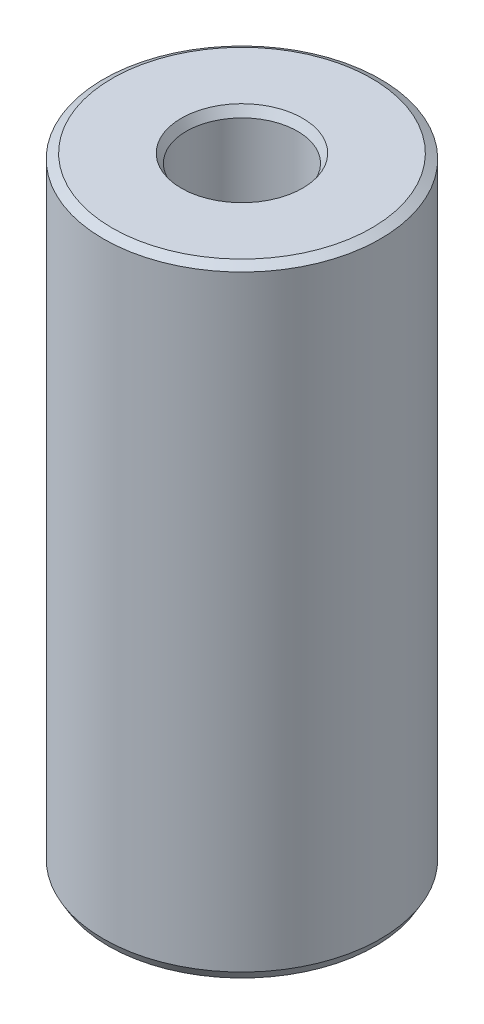
ISO-10303-21;
HEADER;
FILE_DESCRIPTION(('STEP AP214'),'2;1');
FILE_NAME('part.step','',(''),(''),'','','');
FILE_SCHEMA(('AUTOMOTIVE_DESIGN { 1 0 10303 214 1 1 1 1 }'));
ENDSEC;
DATA;
#1=APPLICATION_CONTEXT('core data for automotive mechanical design processes');
#2=APPLICATION_PROTOCOL_DEFINITION('international standard','automotive_design',2000,#1);
#3=PRODUCT_CONTEXT('',#1,'mechanical');
#4=PRODUCT('Part','Part','',(#3));
#5=PRODUCT_RELATED_PRODUCT_CATEGORY('part','',(#4));
#6=PRODUCT_DEFINITION_FORMATION('','',#4);
#7=PRODUCT_DEFINITION_CONTEXT('part definition',#1,'design');
#8=PRODUCT_DEFINITION('design','',#6,#7);
#9=PRODUCT_DEFINITION_SHAPE('','',#8);
#10=(LENGTH_UNIT() NAMED_UNIT(*) SI_UNIT(.MILLI.,.METRE.));
#11=(NAMED_UNIT(*) PLANE_ANGLE_UNIT() SI_UNIT($,.RADIAN.));
#12=(NAMED_UNIT(*) SI_UNIT($,.STERADIAN.) SOLID_ANGLE_UNIT());
#13=UNCERTAINTY_MEASURE_WITH_UNIT(LENGTH_MEASURE(1.E-05),#10,'distance_accuracy_value','');
#14=(GEOMETRIC_REPRESENTATION_CONTEXT(3) GLOBAL_UNCERTAINTY_ASSIGNED_CONTEXT((#13)) GLOBAL_UNIT_ASSIGNED_CONTEXT((#10,
#11,#12)) REPRESENTATION_CONTEXT('',''));
#15=CARTESIAN_POINT('',(0.,0.,0.));
#16=DIRECTION('',(0.,0.,1.));
#17=DIRECTION('',(1.,0.,0.));
#18=AXIS2_PLACEMENT_3D('',#15,#16,#17);
#19=CARTESIAN_POINT('',(0.,44.7857377035556,0.));
#20=DIRECTION('',(0.,-1.,0.));
#21=DIRECTION('',(0.,0.,-1.));
#22=AXIS2_PLACEMENT_3D('',#19,#20,#21);
#23=CYLINDRICAL_SURFACE('',#22,10.);
#24=CARTESIAN_POINT('',(0.,0.631946822583843,0.));
#25=DIRECTION('',(0.,1.,0.));
#26=DIRECTION('',(0.,0.,1.));
#27=AXIS2_PLACEMENT_3D('',#24,#25,#26);
#28=CIRCLE('',#27,10.);
#29=CARTESIAN_POINT('',(0.,0.631946822583842,10.));
#30=VERTEX_POINT('',#29);
#31=EDGE_CURVE('E10',#30,#30,#28,.T.);
#32=ORIENTED_EDGE('',*,*,#31,.T.);
#33=EDGE_LOOP('',(#32));
#34=FACE_BOUND('',#33,.T.);
#35=CARTESIAN_POINT('',(0.,44.4208830354232,0.));
#36=DIRECTION('',(0.,1.,0.));
#37=DIRECTION('',(0.,0.,1.));
#38=AXIS2_PLACEMENT_3D('',#35,#36,#37);
#39=CIRCLE('',#38,10.);
#40=CARTESIAN_POINT('',(0.,44.4208830354232,10.));
#41=VERTEX_POINT('',#40);
#42=EDGE_CURVE('E50',#41,#41,#39,.F.);
#43=ORIENTED_EDGE('',*,*,#42,.T.);
#44=EDGE_LOOP('',(#43));
#45=FACE_BOUND('',#44,.T.);
#46=ADVANCED_FACE('F39',(#34,#45),#23,.T.);
#47=CARTESIAN_POINT('',(0.,44.7857377035556,0.));
#48=DIRECTION('',(0.,1.,0.));
#49=DIRECTION('',(0.,0.,1.));
#50=AXIS2_PLACEMENT_3D('',#47,#48,#49);
#51=PLANE('',#50);
#52=CARTESIAN_POINT('',(0.,44.7857377035556,0.));
#53=DIRECTION('',(0.,1.,0.));
#54=DIRECTION('',(0.,0.,1.));
#55=AXIS2_PLACEMENT_3D('',#52,#53,#54);
#56=CIRCLE('',#55,4.3813838229359);
#57=CARTESIAN_POINT('',(0.,44.7857377035556,4.3813838229359));
#58=VERTEX_POINT('',#57);
#59=EDGE_CURVE('E58',#58,#58,#56,.F.);
#60=ORIENTED_EDGE('',*,*,#59,.T.);
#61=EDGE_LOOP('',(#60));
#62=FACE_BOUND('',#61,.T.);
#63=CARTESIAN_POINT('',(0.,44.7857377035556,0.));
#64=DIRECTION('',(0.,1.,0.));
#65=DIRECTION('',(0.,0.,1.));
#66=AXIS2_PLACEMENT_3D('',#63,#64,#65);
#67=CIRCLE('',#66,9.36805317741615);
#68=CARTESIAN_POINT('',(0.,44.7857377035556,9.36805317741615));
#69=VERTEX_POINT('',#68);
#70=EDGE_CURVE('E61',#69,#69,#67,.T.);
#71=ORIENTED_EDGE('',*,*,#70,.T.);
#72=EDGE_LOOP('',(#71));
#73=FACE_BOUND('',#72,.T.);
#74=ADVANCED_FACE('F88',(#62,#73),#51,.T.);
#75=CARTESIAN_POINT('',(0.,0.,0.));
#76=DIRECTION('',(0.,1.,0.));
#77=DIRECTION('',(0.,0.,1.));
#78=AXIS2_PLACEMENT_3D('',#75,#76,#77);
#79=PLANE('',#78);
#80=CARTESIAN_POINT('',(0.,0.,0.));
#81=DIRECTION('',(0.,1.,0.));
#82=DIRECTION('',(0.,0.,1.));
#83=AXIS2_PLACEMENT_3D('',#80,#81,#82);
#84=CIRCLE('',#83,4.64847597738744);
#85=CARTESIAN_POINT('',(0.,0.,4.64847597738744));
#86=VERTEX_POINT('',#85);
#87=EDGE_CURVE('E51',#86,#86,#84,.T.);
#88=ORIENTED_EDGE('',*,*,#87,.T.);
#89=EDGE_LOOP('',(#88));
#90=FACE_BOUND('',#89,.T.);
#91=CARTESIAN_POINT('',(0.,0.,0.));
#92=DIRECTION('',(0.,1.,0.));
#93=DIRECTION('',(0.,0.,1.));
#94=AXIS2_PLACEMENT_3D('',#91,#92,#93);
#95=CIRCLE('',#94,9.63514533186769);
#96=CARTESIAN_POINT('',(0.,0.,9.63514533186769));
#97=VERTEX_POINT('',#96);
#98=EDGE_CURVE('E54',#97,#97,#95,.F.);
#99=ORIENTED_EDGE('',*,*,#98,.T.);
#100=EDGE_LOOP('',(#99));
#101=FACE_BOUND('',#100,.T.);
#102=ADVANCED_FACE('F83',(#90,#101),#79,.F.);
#103=CARTESIAN_POINT('',(0.,44.7857377035556,0.));
#104=DIRECTION('',(0.,-1.,0.));
#105=DIRECTION('',(0.,0.,-1.));
#106=AXIS2_PLACEMENT_3D('',#103,#104,#105);
#107=CYLINDRICAL_SURFACE('',#106,4.01652915480358);
#108=CARTESIAN_POINT('',(0.,44.1537908809717,0.));
#109=DIRECTION('',(0.,1.,0.));
#110=DIRECTION('',(0.,0.,1.));
#111=AXIS2_PLACEMENT_3D('',#108,#109,#110);
#112=CIRCLE('',#111,4.01652915480358);
#113=CARTESIAN_POINT('',(0.,44.1537908809717,4.01652915480358));
#114=VERTEX_POINT('',#113);
#115=EDGE_CURVE('E67',#114,#114,#112,.T.);
#116=ORIENTED_EDGE('',*,*,#115,.T.);
#117=EDGE_LOOP('',(#116));
#118=FACE_BOUND('',#117,.T.);
#119=CARTESIAN_POINT('',(0.,0.364854668132318,0.));
#120=DIRECTION('',(0.,1.,0.));
#121=DIRECTION('',(0.,0.,1.));
#122=AXIS2_PLACEMENT_3D('',#119,#120,#121);
#123=CIRCLE('',#122,4.01652915480358);
#124=CARTESIAN_POINT('',(0.,0.364854668132318,4.01652915480358));
#125=VERTEX_POINT('',#124);
#126=EDGE_CURVE('E69',#125,#125,#123,.F.);
#127=ORIENTED_EDGE('',*,*,#126,.T.);
#128=EDGE_LOOP('',(#127));
#129=FACE_BOUND('',#128,.T.);
#130=ADVANCED_FACE('F71',(#118,#129),#107,.F.);
#131=CARTESIAN_POINT('',(0.,44.1537908809717,0.));
#132=DIRECTION('',(0.,1.,0.));
#133=DIRECTION('',(0.,0.,1.));
#134=AXIS2_PLACEMENT_3D('',#131,#132,#133);
#135=CONICAL_SURFACE('',#134,4.01652915480358,0.523598775598302);
#136=ORIENTED_EDGE('',*,*,#59,.F.);
#137=EDGE_LOOP('',(#136));
#138=FACE_BOUND('',#137,.T.);
#139=ORIENTED_EDGE('',*,*,#115,.F.);
#140=EDGE_LOOP('',(#139));
#141=FACE_BOUND('',#140,.T.);
#142=ADVANCED_FACE('F77',(#138,#141),#135,.F.);
#143=CARTESIAN_POINT('',(0.,0.,0.));
#144=DIRECTION('',(0.,-1.,0.));
#145=DIRECTION('',(0.,0.,-1.));
#146=AXIS2_PLACEMENT_3D('',#143,#144,#145);
#147=CONICAL_SURFACE('',#146,4.64847597738744,1.0471975511966);
#148=ORIENTED_EDGE('',*,*,#126,.F.);
#149=EDGE_LOOP('',(#148));
#150=FACE_BOUND('',#149,.T.);
#151=ORIENTED_EDGE('',*,*,#87,.F.);
#152=EDGE_LOOP('',(#151));
#153=FACE_BOUND('',#152,.T.);
#154=ADVANCED_FACE('F73',(#150,#153),#147,.F.);
#155=CARTESIAN_POINT('',(0.,0.631946822583843,0.));
#156=DIRECTION('',(0.,1.,0.));
#157=DIRECTION('',(0.,0.,1.));
#158=AXIS2_PLACEMENT_3D('',#155,#156,#157);
#159=CONICAL_SURFACE('',#158,10.,0.5235987755983);
#160=CARTESIAN_POINT('',(0.,0.,9.63514533186769));
#161=CARTESIAN_POINT('',(0.,0.00658277940191474,9.6389459013274));
#162=CARTESIAN_POINT('',(0.,0.0131655588038299,9.64274647078711));
#163=CARTESIAN_POINT('',(0.,0.0263311176076601,9.65034760970654));
#164=CARTESIAN_POINT('',(0.,0.0329138970095752,9.65414817916625));
#165=CARTESIAN_POINT('',(0.,0.0460794558134052,9.66174931808567));
#166=CARTESIAN_POINT('',(0.,0.05266223521532,9.66554988754538));
#167=CARTESIAN_POINT('',(0.,0.06582779401915,9.67315102646481));
#168=CARTESIAN_POINT('',(0.,0.0724105734210652,9.67695159592452));
#169=CARTESIAN_POINT('',(0.,0.0855761322248953,9.68455273484394));
#170=CARTESIAN_POINT('',(0.,0.0921589116268102,9.68835330430365));
#171=CARTESIAN_POINT('',(0.,0.10532447043064,9.69595444322308));
#172=CARTESIAN_POINT('',(0.,0.111907249832556,9.69975501268279));
#173=CARTESIAN_POINT('',(0.,0.125072808636386,9.70735615160221));
#174=CARTESIAN_POINT('',(0.,0.1316555880383,9.71115672106192));
#175=CARTESIAN_POINT('',(0.,0.14482114684213,9.71875785998135));
#176=CARTESIAN_POINT('',(0.,0.151403926244045,9.72255842944106));
#177=CARTESIAN_POINT('',(0.,0.164569485047876,9.73015956836048));
#178=CARTESIAN_POINT('',(0.,0.171152264449791,9.73396013782019));
#179=CARTESIAN_POINT('',(0.,0.184317823253621,9.74156127673962));
#180=CARTESIAN_POINT('',(0.,0.190900602655536,9.74536184619932));
#181=CARTESIAN_POINT('',(0.,0.204066161459366,9.75296298511875));
#182=CARTESIAN_POINT('',(0.,0.210648940861281,9.75676355457846));
#183=CARTESIAN_POINT('',(0.,0.223814499665111,9.76436469349789));
#184=CARTESIAN_POINT('',(0.,0.230397279067026,9.7681652629576));
#185=CARTESIAN_POINT('',(0.,0.243562837870856,9.77576640187702));
#186=CARTESIAN_POINT('',(0.,0.250145617272771,9.77956697133673));
#187=CARTESIAN_POINT('',(0.,0.263311176076601,9.78716811025615));
#188=CARTESIAN_POINT('',(0.,0.269893955478516,9.79096867971586));
#189=CARTESIAN_POINT('',(0.,0.283059514282346,9.79856981863529));
#190=CARTESIAN_POINT('',(0.,0.289642293684261,9.802370388095));
#191=CARTESIAN_POINT('',(0.,0.302807852488091,9.80997152701442));
#192=CARTESIAN_POINT('',(0.,0.309390631890006,9.81377209647413));
#193=CARTESIAN_POINT('',(0.,0.322556190693836,9.82137323539356));
#194=CARTESIAN_POINT('',(0.,0.329138970095751,9.82517380485327));
#195=CARTESIAN_POINT('',(0.,0.342304528899581,9.83277494377269));
#196=CARTESIAN_POINT('',(0.,0.348887308301497,9.8365755132324));
#197=CARTESIAN_POINT('',(0.,0.362052867105326,9.84417665215183));
#198=CARTESIAN_POINT('',(0.,0.368635646507241,9.84797722161154));
#199=CARTESIAN_POINT('',(0.,0.381801205311071,9.85557836053096));
#200=CARTESIAN_POINT('',(0.,0.388383984712986,9.85937892999067));
#201=CARTESIAN_POINT('',(0.,0.401549543516817,9.8669800689101));
#202=CARTESIAN_POINT('',(0.,0.408132322918732,9.87078063836981));
#203=CARTESIAN_POINT('',(0.,0.421297881722562,9.87838177728923));
#204=CARTESIAN_POINT('',(0.,0.427880661124477,9.88218234674894));
#205=CARTESIAN_POINT('',(0.,0.441046219928307,9.88978348566837));
#206=CARTESIAN_POINT('',(0.,0.447628999330222,9.89358405512808));
#207=CARTESIAN_POINT('',(0.,0.460794558134052,9.9011851940475));
#208=CARTESIAN_POINT('',(0.,0.467377337535967,9.90498576350721));
#209=CARTESIAN_POINT('',(0.,0.480542896339797,9.91258690242664));
#210=CARTESIAN_POINT('',(0.,0.487125675741712,9.91638747188635));
#211=CARTESIAN_POINT('',(0.,0.500291234545542,9.92398861080577));
#212=CARTESIAN_POINT('',(0.,0.506874013947457,9.92778918026548));
#213=CARTESIAN_POINT('',(0.,0.520039572751287,9.9353903191849));
#214=CARTESIAN_POINT('',(0.,0.526622352153202,9.93919088864462));
#215=CARTESIAN_POINT('',(0.,0.539787910957032,9.94679202756404));
#216=CARTESIAN_POINT('',(0.,0.546370690358947,9.95059259702375));
#217=CARTESIAN_POINT('',(0.,0.559536249162777,9.95819373594317));
#218=CARTESIAN_POINT('',(0.,0.566119028564692,9.96199430540289));
#219=CARTESIAN_POINT('',(0.,0.579284587368522,9.96959544432231));
#220=CARTESIAN_POINT('',(0.,0.585867366770437,9.97339601378202));
#221=CARTESIAN_POINT('',(0.,0.599032925574267,9.98099715270144));
#222=CARTESIAN_POINT('',(0.,0.605615704976182,9.98479772216116));
#223=CARTESIAN_POINT('',(0.,0.618781263780012,9.99239886108058));
#224=CARTESIAN_POINT('',(0.,0.625364043181927,9.99619943054029));
#225=CARTESIAN_POINT('',(0.,0.631946822583842,10.));
#226=B_SPLINE_CURVE_WITH_KNOTS('',3,(#160,#161,#162,#163,#164,#165,#166,#167,#168,#169,#170,
#171,#172,#173,#174,#175,#176,#177,#178,#179,#180,#181,#182,#183,#184,#185,#186,#187,#188,#189,
#190,#191,#192,#193,#194,#195,#196,#197,#198,#199,#200,#201,#202,#203,#204,#205,#206,#207,#208,
#209,#210,#211,#212,#213,#214,#215,#216,#217,#218,#219,#220,#221,#222,#223,#224,#225),
.UNSPECIFIED.,.F.,.F.,(4,2,2,2,2,2,2,2,2,2,2,2,2,2,2,2,2,2,2,2,2,2,2,2,2,2,2,2,2,2,2,2,4),(0.,
0.0228034167582692,0.0456068335165384,0.0684102502748084,0.0912136670330776,0.114017083791347,
0.136820500549616,0.159623917307886,0.182427334066155,0.205230750824424,0.228034167582693,
0.250837584340964,0.273641001099233,0.296444417857502,0.319247834615771,0.342051251374041,
0.36485466813231,0.38765808489058,0.410461501648849,0.433264918407119,0.456068335165388,
0.478871751923657,0.501675168681926,0.524478585440196,0.547282002198466,0.570085418956735,
0.592888835715004,0.615692252473274,0.638495669231543,0.661299085989813,0.684102502748082,
0.706905919506352,0.729709336264621),.UNSPECIFIED.);
#227=EDGE_CURVE('BSEAM76',#97,#30,#226,.T.);
#228=ORIENTED_EDGE('',*,*,#98,.F.);
#229=ORIENTED_EDGE('',*,*,#31,.F.);
#230=ORIENTED_EDGE('',*,*,#227,.T.);
#231=ORIENTED_EDGE('',*,*,#227,.F.);
#232=EDGE_LOOP('',(#228,#230,#229,#231));
#233=FACE_BOUND('',#232,.T.);
#234=ADVANCED_FACE('F76',(#233),#159,.T.);
#235=CARTESIAN_POINT('',(0.,44.7857377035556,0.));
#236=DIRECTION('',(0.,-1.,0.));
#237=DIRECTION('',(0.,0.,-1.));
#238=AXIS2_PLACEMENT_3D('',#235,#236,#237);
#239=CONICAL_SURFACE('',#238,9.36805317741615,1.04719755119659);
#240=ORIENTED_EDGE('',*,*,#42,.F.);
#241=EDGE_LOOP('',(#240));
#242=FACE_BOUND('',#241,.T.);
#243=ORIENTED_EDGE('',*,*,#70,.F.);
#244=EDGE_LOOP('',(#243));
#245=FACE_BOUND('',#244,.T.);
#246=ADVANCED_FACE('F45',(#242,#245),#239,.T.);
#247=CLOSED_SHELL('',(#46,#74,#102,#130,#142,#154,#234,#246));
#248=MANIFOLD_SOLID_BREP('B2',#247);
#249=ADVANCED_BREP_SHAPE_REPRESENTATION('',(#18,#248),#14);
#250=SHAPE_DEFINITION_REPRESENTATION(#9,#249);
ENDSEC;
END-ISO-10303-21;
